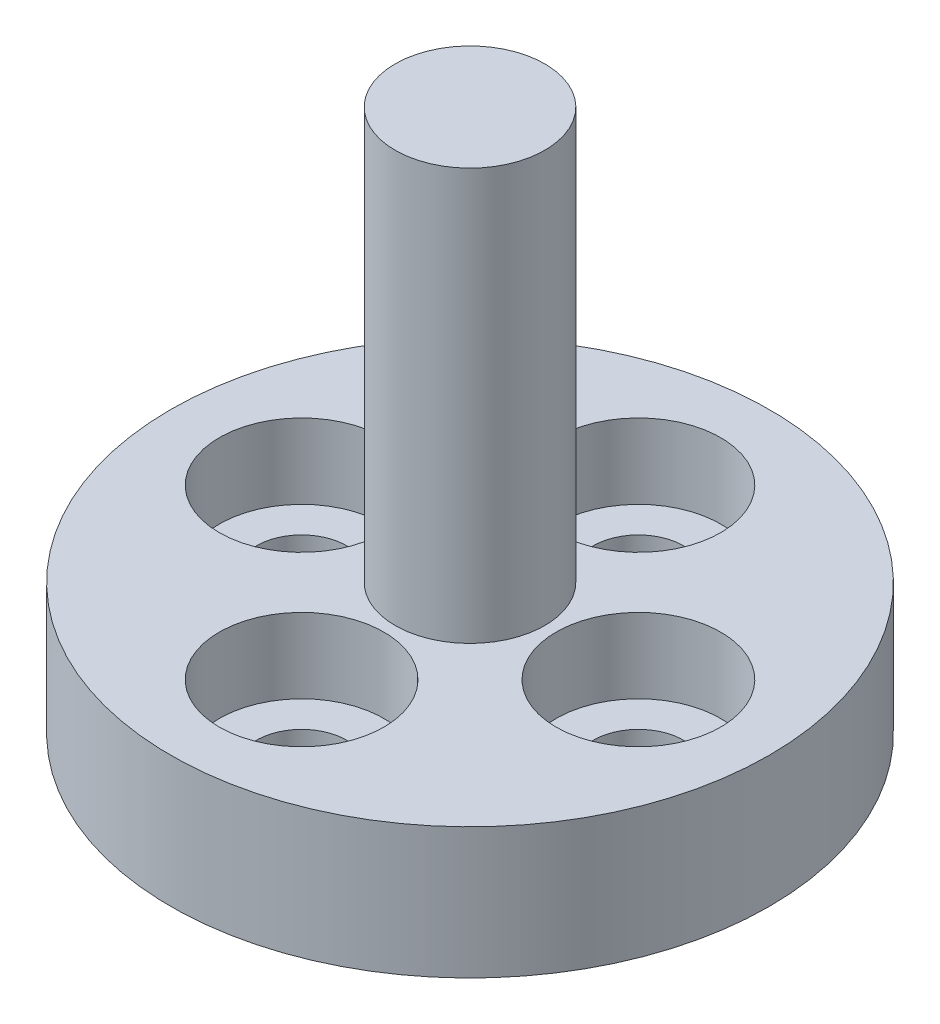
ISO-10303-21;
HEADER;
FILE_DESCRIPTION(('STEP AP214'),'2;1');
FILE_NAME('part.step','',(''),(''),'','','');
FILE_SCHEMA(('AUTOMOTIVE_DESIGN { 1 0 10303 214 1 1 1 1 }'));
ENDSEC;
DATA;
#1=APPLICATION_CONTEXT('core data for automotive mechanical design processes');
#2=APPLICATION_PROTOCOL_DEFINITION('international standard','automotive_design',2000,#1);
#3=PRODUCT_CONTEXT('',#1,'mechanical');
#4=PRODUCT('Part','Part','',(#3));
#5=PRODUCT_RELATED_PRODUCT_CATEGORY('part','',(#4));
#6=PRODUCT_DEFINITION_FORMATION('','',#4);
#7=PRODUCT_DEFINITION_CONTEXT('part definition',#1,'design');
#8=PRODUCT_DEFINITION('design','',#6,#7);
#9=PRODUCT_DEFINITION_SHAPE('','',#8);
#10=(LENGTH_UNIT() NAMED_UNIT(*) SI_UNIT(.MILLI.,.METRE.));
#11=(NAMED_UNIT(*) PLANE_ANGLE_UNIT() SI_UNIT($,.RADIAN.));
#12=(NAMED_UNIT(*) SI_UNIT($,.STERADIAN.) SOLID_ANGLE_UNIT());
#13=UNCERTAINTY_MEASURE_WITH_UNIT(LENGTH_MEASURE(1.E-05),#10,'distance_accuracy_value','');
#14=(GEOMETRIC_REPRESENTATION_CONTEXT(3) GLOBAL_UNCERTAINTY_ASSIGNED_CONTEXT((#13)) GLOBAL_UNIT_ASSIGNED_CONTEXT((#10,
#11,#12)) REPRESENTATION_CONTEXT('',''));
#15=CARTESIAN_POINT('',(0.,0.,0.));
#16=DIRECTION('',(0.,0.,1.));
#17=DIRECTION('',(1.,0.,0.));
#18=AXIS2_PLACEMENT_3D('',#15,#16,#17);
#19=CARTESIAN_POINT('',(8.,3.5,0.));
#20=DIRECTION('',(0.,-1.,0.));
#21=DIRECTION('',(1.,0.,0.));
#22=AXIS2_PLACEMENT_3D('',#19,#20,#21);
#23=PLANE('',#22);
#24=CARTESIAN_POINT('',(4.5,3.5,0.));
#25=DIRECTION('',(0.,1.,0.));
#26=DIRECTION('',(0.,0.,1.));
#27=AXIS2_PLACEMENT_3D('',#24,#25,#26);
#28=CIRCLE('',#27,2.19999999999999);
#29=CARTESIAN_POINT('',(4.5,3.5,2.19999999999999));
#30=VERTEX_POINT('',#29);
#31=EDGE_CURVE('E98',#30,#30,#28,.T.);
#32=ORIENTED_EDGE('',*,*,#31,.F.);
#33=EDGE_LOOP('',(#32));
#34=FACE_BOUND('',#33,.T.);
#35=CARTESIAN_POINT('',(0.,3.5,4.5));
#36=DIRECTION('',(0.,1.,0.));
#37=DIRECTION('',(0.,0.,1.));
#38=AXIS2_PLACEMENT_3D('',#35,#36,#37);
#39=CIRCLE('',#38,2.19999999999999);
#40=CARTESIAN_POINT('',(0.,3.5,6.69999999999999));
#41=VERTEX_POINT('',#40);
#42=EDGE_CURVE('E86',#41,#41,#39,.T.);
#43=ORIENTED_EDGE('',*,*,#42,.F.);
#44=EDGE_LOOP('',(#43));
#45=FACE_BOUND('',#44,.T.);
#46=CARTESIAN_POINT('',(-4.5,3.5,0.));
#47=DIRECTION('',(0.,1.,0.));
#48=DIRECTION('',(0.,0.,1.));
#49=AXIS2_PLACEMENT_3D('',#46,#47,#48);
#50=CIRCLE('',#49,2.19999999999999);
#51=CARTESIAN_POINT('',(-4.5,3.5,2.19999999999999));
#52=VERTEX_POINT('',#51);
#53=EDGE_CURVE('E62',#52,#52,#50,.T.);
#54=ORIENTED_EDGE('',*,*,#53,.F.);
#55=EDGE_LOOP('',(#54));
#56=FACE_BOUND('',#55,.T.);
#57=CARTESIAN_POINT('',(0.,3.5,0.));
#58=DIRECTION('',(0.,1.,0.));
#59=DIRECTION('',(-1.,0.,0.));
#60=AXIS2_PLACEMENT_3D('',#57,#58,#59);
#61=CIRCLE('',#60,2.);
#62=CARTESIAN_POINT('',(-2.,3.5,0.));
#63=VERTEX_POINT('',#62);
#64=EDGE_CURVE('E44',#63,#63,#61,.T.);
#65=ORIENTED_EDGE('',*,*,#64,.F.);
#66=EDGE_LOOP('',(#65));
#67=FACE_BOUND('',#66,.T.);
#68=CARTESIAN_POINT('',(0.,3.5,0.));
#69=DIRECTION('',(0.,1.,0.));
#70=DIRECTION('',(-1.,0.,0.));
#71=AXIS2_PLACEMENT_3D('',#68,#69,#70);
#72=CIRCLE('',#71,8.);
#73=CARTESIAN_POINT('',(-8.,3.5,0.));
#74=VERTEX_POINT('',#73);
#75=EDGE_CURVE('E40',#74,#74,#72,.T.);
#76=ORIENTED_EDGE('',*,*,#75,.T.);
#77=EDGE_LOOP('',(#76));
#78=FACE_BOUND('',#77,.T.);
#79=CARTESIAN_POINT('',(0.,3.5,-4.5));
#80=DIRECTION('',(0.,1.,0.));
#81=DIRECTION('',(0.,0.,1.));
#82=AXIS2_PLACEMENT_3D('',#79,#80,#81);
#83=CIRCLE('',#82,2.19999999999999);
#84=CARTESIAN_POINT('',(0.,3.5,-2.30000000000001));
#85=VERTEX_POINT('',#84);
#86=EDGE_CURVE('E74',#85,#85,#83,.T.);
#87=ORIENTED_EDGE('',*,*,#86,.F.);
#88=EDGE_LOOP('',(#87));
#89=FACE_BOUND('',#88,.T.);
#90=ADVANCED_FACE('F33',(#34,#45,#56,#67,#78,#89),#23,.F.);
#91=CARTESIAN_POINT('',(0.,0.,0.));
#92=DIRECTION('',(0.,1.,0.));
#93=DIRECTION('',(-1.,0.,0.));
#94=AXIS2_PLACEMENT_3D('',#91,#92,#93);
#95=PLANE('',#94);
#96=CARTESIAN_POINT('',(4.5,0.,0.));
#97=DIRECTION('',(0.,1.,0.));
#98=DIRECTION('',(0.,0.,1.));
#99=AXIS2_PLACEMENT_3D('',#96,#97,#98);
#100=CIRCLE('',#99,1.2);
#101=CARTESIAN_POINT('',(4.5,0.,1.2));
#102=VERTEX_POINT('',#101);
#103=EDGE_CURVE('E89',#102,#102,#100,.T.);
#104=ORIENTED_EDGE('',*,*,#103,.T.);
#105=EDGE_LOOP('',(#104));
#106=FACE_BOUND('',#105,.T.);
#107=CARTESIAN_POINT('',(0.,0.,4.5));
#108=DIRECTION('',(0.,1.,0.));
#109=DIRECTION('',(0.,0.,1.));
#110=AXIS2_PLACEMENT_3D('',#107,#108,#109);
#111=CIRCLE('',#110,1.2);
#112=CARTESIAN_POINT('',(0.,0.,5.7));
#113=VERTEX_POINT('',#112);
#114=EDGE_CURVE('E77',#113,#113,#111,.T.);
#115=ORIENTED_EDGE('',*,*,#114,.T.);
#116=EDGE_LOOP('',(#115));
#117=FACE_BOUND('',#116,.T.);
#118=CARTESIAN_POINT('',(0.,0.,-4.5));
#119=DIRECTION('',(0.,1.,0.));
#120=DIRECTION('',(0.,0.,1.));
#121=AXIS2_PLACEMENT_3D('',#118,#119,#120);
#122=CIRCLE('',#121,1.2);
#123=CARTESIAN_POINT('',(0.,0.,-3.3));
#124=VERTEX_POINT('',#123);
#125=EDGE_CURVE('E65',#124,#124,#122,.T.);
#126=ORIENTED_EDGE('',*,*,#125,.T.);
#127=EDGE_LOOP('',(#126));
#128=FACE_BOUND('',#127,.T.);
#129=CARTESIAN_POINT('',(-4.5,0.,0.));
#130=DIRECTION('',(0.,1.,0.));
#131=DIRECTION('',(0.,0.,1.));
#132=AXIS2_PLACEMENT_3D('',#129,#130,#131);
#133=CIRCLE('',#132,1.2);
#134=CARTESIAN_POINT('',(-4.5,0.,1.2));
#135=VERTEX_POINT('',#134);
#136=EDGE_CURVE('E53',#135,#135,#133,.T.);
#137=ORIENTED_EDGE('',*,*,#136,.T.);
#138=EDGE_LOOP('',(#137));
#139=FACE_BOUND('',#138,.T.);
#140=CARTESIAN_POINT('',(0.,0.,0.));
#141=DIRECTION('',(0.,1.,0.));
#142=DIRECTION('',(-1.,0.,0.));
#143=AXIS2_PLACEMENT_3D('',#140,#141,#142);
#144=CIRCLE('',#143,8.);
#145=CARTESIAN_POINT('',(-8.,0.,0.));
#146=VERTEX_POINT('',#145);
#147=EDGE_CURVE('E10',#146,#146,#144,.T.);
#148=ORIENTED_EDGE('',*,*,#147,.F.);
#149=EDGE_LOOP('',(#148));
#150=FACE_BOUND('',#149,.T.);
#151=ADVANCED_FACE('F35',(#106,#117,#128,#139,#150),#95,.F.);
#152=CARTESIAN_POINT('',(0.,14.5,0.));
#153=DIRECTION('',(0.,1.,0.));
#154=DIRECTION('',(-1.,0.,0.));
#155=AXIS2_PLACEMENT_3D('',#152,#153,#154);
#156=CYLINDRICAL_SURFACE('',#155,8.);
#157=ORIENTED_EDGE('',*,*,#75,.F.);
#158=EDGE_LOOP('',(#157));
#159=FACE_BOUND('',#158,.T.);
#160=ORIENTED_EDGE('',*,*,#147,.T.);
#161=EDGE_LOOP('',(#160));
#162=FACE_BOUND('',#161,.T.);
#163=ADVANCED_FACE('F155',(#159,#162),#156,.T.);
#164=CARTESIAN_POINT('',(0.,14.5,0.));
#165=DIRECTION('',(0.,1.,0.));
#166=DIRECTION('',(-1.,0.,0.));
#167=AXIS2_PLACEMENT_3D('',#164,#165,#166);
#168=CYLINDRICAL_SURFACE('',#167,2.);
#169=CARTESIAN_POINT('',(0.,14.5,0.));
#170=DIRECTION('',(0.,1.,0.));
#171=DIRECTION('',(-1.,0.,0.));
#172=AXIS2_PLACEMENT_3D('',#169,#170,#171);
#173=CIRCLE('',#172,2.);
#174=CARTESIAN_POINT('',(-2.,14.5,0.));
#175=VERTEX_POINT('',#174);
#176=EDGE_CURVE('E48',#175,#175,#173,.T.);
#177=ORIENTED_EDGE('',*,*,#176,.F.);
#178=EDGE_LOOP('',(#177));
#179=FACE_BOUND('',#178,.T.);
#180=ORIENTED_EDGE('',*,*,#64,.T.);
#181=EDGE_LOOP('',(#180));
#182=FACE_BOUND('',#181,.T.);
#183=ADVANCED_FACE('F152',(#179,#182),#168,.T.);
#184=CARTESIAN_POINT('',(2.,14.5,0.));
#185=DIRECTION('',(0.,-1.,0.));
#186=DIRECTION('',(1.,0.,0.));
#187=AXIS2_PLACEMENT_3D('',#184,#185,#186);
#188=PLANE('',#187);
#189=ORIENTED_EDGE('',*,*,#176,.T.);
#190=EDGE_LOOP('',(#189));
#191=FACE_BOUND('',#190,.T.);
#192=ADVANCED_FACE('F148',(#191),#188,.F.);
#193=CARTESIAN_POINT('',(-4.5,3.5,0.));
#194=DIRECTION('',(0.,1.,0.));
#195=DIRECTION('',(0.,0.,1.));
#196=AXIS2_PLACEMENT_3D('',#193,#194,#195);
#197=CYLINDRICAL_SURFACE('',#196,1.20000000000001);
#198=ORIENTED_EDGE('',*,*,#136,.F.);
#199=EDGE_LOOP('',(#198));
#200=FACE_BOUND('',#199,.T.);
#201=CARTESIAN_POINT('',(-4.5,1.5,0.));
#202=DIRECTION('',(0.,1.,0.));
#203=DIRECTION('',(0.,0.,1.));
#204=AXIS2_PLACEMENT_3D('',#201,#202,#203);
#205=CIRCLE('',#204,1.20000000000001);
#206=CARTESIAN_POINT('',(-4.5,1.5,1.20000000000001));
#207=VERTEX_POINT('',#206);
#208=EDGE_CURVE('E56',#207,#207,#205,.T.);
#209=ORIENTED_EDGE('',*,*,#208,.T.);
#210=EDGE_LOOP('',(#209));
#211=FACE_BOUND('',#210,.T.);
#212=ADVANCED_FACE('F144',(#200,#211),#197,.F.);
#213=CARTESIAN_POINT('',(-3.29999999999999,1.5,0.));
#214=DIRECTION('',(0.,-1.,0.));
#215=DIRECTION('',(0.,0.,-1.));
#216=AXIS2_PLACEMENT_3D('',#213,#214,#215);
#217=PLANE('',#216);
#218=ORIENTED_EDGE('',*,*,#208,.F.);
#219=EDGE_LOOP('',(#218));
#220=FACE_BOUND('',#219,.T.);
#221=CARTESIAN_POINT('',(-4.5,1.5,0.));
#222=DIRECTION('',(0.,1.,0.));
#223=DIRECTION('',(0.,0.,1.));
#224=AXIS2_PLACEMENT_3D('',#221,#222,#223);
#225=CIRCLE('',#224,2.19999999999999);
#226=CARTESIAN_POINT('',(-4.5,1.5,2.19999999999999));
#227=VERTEX_POINT('',#226);
#228=EDGE_CURVE('E59',#227,#227,#225,.T.);
#229=ORIENTED_EDGE('',*,*,#228,.T.);
#230=EDGE_LOOP('',(#229));
#231=FACE_BOUND('',#230,.T.);
#232=ADVANCED_FACE('F140',(#220,#231),#217,.F.);
#233=CARTESIAN_POINT('',(-4.5,3.5,0.));
#234=DIRECTION('',(0.,1.,0.));
#235=DIRECTION('',(0.,0.,1.));
#236=AXIS2_PLACEMENT_3D('',#233,#234,#235);
#237=CYLINDRICAL_SURFACE('',#236,2.19999999999999);
#238=ORIENTED_EDGE('',*,*,#228,.F.);
#239=EDGE_LOOP('',(#238));
#240=FACE_BOUND('',#239,.T.);
#241=ORIENTED_EDGE('',*,*,#53,.T.);
#242=EDGE_LOOP('',(#241));
#243=FACE_BOUND('',#242,.T.);
#244=ADVANCED_FACE('F136',(#240,#243),#237,.F.);
#245=CARTESIAN_POINT('',(0.,3.5,-4.5));
#246=DIRECTION('',(0.,1.,0.));
#247=DIRECTION('',(0.,0.,1.));
#248=AXIS2_PLACEMENT_3D('',#245,#246,#247);
#249=CYLINDRICAL_SURFACE('',#248,1.20000000000001);
#250=ORIENTED_EDGE('',*,*,#125,.F.);
#251=EDGE_LOOP('',(#250));
#252=FACE_BOUND('',#251,.T.);
#253=CARTESIAN_POINT('',(0.,1.5,-4.5));
#254=DIRECTION('',(0.,1.,0.));
#255=DIRECTION('',(0.,0.,1.));
#256=AXIS2_PLACEMENT_3D('',#253,#254,#255);
#257=CIRCLE('',#256,1.20000000000001);
#258=CARTESIAN_POINT('',(0.,1.5,-3.29999999999999));
#259=VERTEX_POINT('',#258);
#260=EDGE_CURVE('E68',#259,#259,#257,.T.);
#261=ORIENTED_EDGE('',*,*,#260,.T.);
#262=EDGE_LOOP('',(#261));
#263=FACE_BOUND('',#262,.T.);
#264=ADVANCED_FACE('F128',(#252,#263),#249,.F.);
#265=CARTESIAN_POINT('',(1.20000000000001,1.5,-4.5));
#266=DIRECTION('',(0.,-1.,0.));
#267=DIRECTION('',(0.,0.,-1.));
#268=AXIS2_PLACEMENT_3D('',#265,#266,#267);
#269=PLANE('',#268);
#270=ORIENTED_EDGE('',*,*,#260,.F.);
#271=EDGE_LOOP('',(#270));
#272=FACE_BOUND('',#271,.T.);
#273=CARTESIAN_POINT('',(0.,1.5,-4.5));
#274=DIRECTION('',(0.,1.,0.));
#275=DIRECTION('',(0.,0.,1.));
#276=AXIS2_PLACEMENT_3D('',#273,#274,#275);
#277=CIRCLE('',#276,2.19999999999999);
#278=CARTESIAN_POINT('',(0.,1.5,-2.30000000000001));
#279=VERTEX_POINT('',#278);
#280=EDGE_CURVE('E71',#279,#279,#277,.T.);
#281=ORIENTED_EDGE('',*,*,#280,.T.);
#282=EDGE_LOOP('',(#281));
#283=FACE_BOUND('',#282,.T.);
#284=ADVANCED_FACE('F118',(#272,#283),#269,.F.);
#285=CARTESIAN_POINT('',(0.,3.5,-4.5));
#286=DIRECTION('',(0.,1.,0.));
#287=DIRECTION('',(0.,0.,1.));
#288=AXIS2_PLACEMENT_3D('',#285,#286,#287);
#289=CYLINDRICAL_SURFACE('',#288,2.19999999999999);
#290=ORIENTED_EDGE('',*,*,#280,.F.);
#291=EDGE_LOOP('',(#290));
#292=FACE_BOUND('',#291,.T.);
#293=ORIENTED_EDGE('',*,*,#86,.T.);
#294=EDGE_LOOP('',(#293));
#295=FACE_BOUND('',#294,.T.);
#296=ADVANCED_FACE('F115',(#292,#295),#289,.F.);
#297=CARTESIAN_POINT('',(0.,3.5,4.5));
#298=DIRECTION('',(0.,1.,0.));
#299=DIRECTION('',(0.,0.,1.));
#300=AXIS2_PLACEMENT_3D('',#297,#298,#299);
#301=CYLINDRICAL_SURFACE('',#300,1.20000000000001);
#302=ORIENTED_EDGE('',*,*,#114,.F.);
#303=EDGE_LOOP('',(#302));
#304=FACE_BOUND('',#303,.T.);
#305=CARTESIAN_POINT('',(0.,1.5,4.5));
#306=DIRECTION('',(0.,1.,0.));
#307=DIRECTION('',(0.,0.,1.));
#308=AXIS2_PLACEMENT_3D('',#305,#306,#307);
#309=CIRCLE('',#308,1.20000000000001);
#310=CARTESIAN_POINT('',(0.,1.5,5.70000000000001));
#311=VERTEX_POINT('',#310);
#312=EDGE_CURVE('E80',#311,#311,#309,.T.);
#313=ORIENTED_EDGE('',*,*,#312,.T.);
#314=EDGE_LOOP('',(#313));
#315=FACE_BOUND('',#314,.T.);
#316=ADVANCED_FACE('F117',(#304,#315),#301,.F.);
#317=CARTESIAN_POINT('',(1.20000000000001,1.5,4.5));
#318=DIRECTION('',(0.,-1.,0.));
#319=DIRECTION('',(0.,0.,-1.));
#320=AXIS2_PLACEMENT_3D('',#317,#318,#319);
#321=PLANE('',#320);
#322=ORIENTED_EDGE('',*,*,#312,.F.);
#323=EDGE_LOOP('',(#322));
#324=FACE_BOUND('',#323,.T.);
#325=CARTESIAN_POINT('',(0.,1.5,4.5));
#326=DIRECTION('',(0.,1.,0.));
#327=DIRECTION('',(0.,0.,1.));
#328=AXIS2_PLACEMENT_3D('',#325,#326,#327);
#329=CIRCLE('',#328,2.19999999999999);
#330=CARTESIAN_POINT('',(0.,1.5,6.69999999999999));
#331=VERTEX_POINT('',#330);
#332=EDGE_CURVE('E83',#331,#331,#329,.T.);
#333=ORIENTED_EDGE('',*,*,#332,.T.);
#334=EDGE_LOOP('',(#333));
#335=FACE_BOUND('',#334,.T.);
#336=ADVANCED_FACE('F125',(#324,#335),#321,.F.);
#337=CARTESIAN_POINT('',(0.,3.5,4.5));
#338=DIRECTION('',(0.,1.,0.));
#339=DIRECTION('',(0.,0.,1.));
#340=AXIS2_PLACEMENT_3D('',#337,#338,#339);
#341=CYLINDRICAL_SURFACE('',#340,2.19999999999999);
#342=ORIENTED_EDGE('',*,*,#332,.F.);
#343=EDGE_LOOP('',(#342));
#344=FACE_BOUND('',#343,.T.);
#345=ORIENTED_EDGE('',*,*,#42,.T.);
#346=EDGE_LOOP('',(#345));
#347=FACE_BOUND('',#346,.T.);
#348=ADVANCED_FACE('F186',(#344,#347),#341,.F.);
#349=CARTESIAN_POINT('',(4.5,3.5,0.));
#350=DIRECTION('',(0.,1.,0.));
#351=DIRECTION('',(0.,0.,1.));
#352=AXIS2_PLACEMENT_3D('',#349,#350,#351);
#353=CYLINDRICAL_SURFACE('',#352,1.20000000000001);
#354=ORIENTED_EDGE('',*,*,#103,.F.);
#355=EDGE_LOOP('',(#354));
#356=FACE_BOUND('',#355,.T.);
#357=CARTESIAN_POINT('',(4.5,1.5,0.));
#358=DIRECTION('',(0.,1.,0.));
#359=DIRECTION('',(0.,0.,1.));
#360=AXIS2_PLACEMENT_3D('',#357,#358,#359);
#361=CIRCLE('',#360,1.20000000000001);
#362=CARTESIAN_POINT('',(4.5,1.5,1.20000000000001));
#363=VERTEX_POINT('',#362);
#364=EDGE_CURVE('E92',#363,#363,#361,.T.);
#365=ORIENTED_EDGE('',*,*,#364,.T.);
#366=EDGE_LOOP('',(#365));
#367=FACE_BOUND('',#366,.T.);
#368=ADVANCED_FACE('F191',(#356,#367),#353,.F.);
#369=CARTESIAN_POINT('',(5.70000000000001,1.5,0.));
#370=DIRECTION('',(0.,-1.,0.));
#371=DIRECTION('',(0.,0.,-1.));
#372=AXIS2_PLACEMENT_3D('',#369,#370,#371);
#373=PLANE('',#372);
#374=ORIENTED_EDGE('',*,*,#364,.F.);
#375=EDGE_LOOP('',(#374));
#376=FACE_BOUND('',#375,.T.);
#377=CARTESIAN_POINT('',(4.5,1.5,0.));
#378=DIRECTION('',(0.,1.,0.));
#379=DIRECTION('',(0.,0.,1.));
#380=AXIS2_PLACEMENT_3D('',#377,#378,#379);
#381=CIRCLE('',#380,2.19999999999999);
#382=CARTESIAN_POINT('',(4.5,1.5,2.19999999999999));
#383=VERTEX_POINT('',#382);
#384=EDGE_CURVE('E95',#383,#383,#381,.T.);
#385=ORIENTED_EDGE('',*,*,#384,.T.);
#386=EDGE_LOOP('',(#385));
#387=FACE_BOUND('',#386,.T.);
#388=ADVANCED_FACE('F196',(#376,#387),#373,.F.);
#389=CARTESIAN_POINT('',(4.5,3.5,0.));
#390=DIRECTION('',(0.,1.,0.));
#391=DIRECTION('',(0.,0.,1.));
#392=AXIS2_PLACEMENT_3D('',#389,#390,#391);
#393=CYLINDRICAL_SURFACE('',#392,2.19999999999999);
#394=ORIENTED_EDGE('',*,*,#384,.F.);
#395=EDGE_LOOP('',(#394));
#396=FACE_BOUND('',#395,.T.);
#397=ORIENTED_EDGE('',*,*,#31,.T.);
#398=EDGE_LOOP('',(#397));
#399=FACE_BOUND('',#398,.T.);
#400=ADVANCED_FACE('F102',(#396,#399),#393,.F.);
#401=CLOSED_SHELL('',(#90,#151,#163,#183,#192,#212,#232,#244,#264,#284,#296,#316,#336,#348,#368,
#388,#400));
#402=MANIFOLD_SOLID_BREP('B2',#401);
#403=ADVANCED_BREP_SHAPE_REPRESENTATION('',(#18,#402),#14);
#404=SHAPE_DEFINITION_REPRESENTATION(#9,#403);
ENDSEC;
END-ISO-10303-21;
